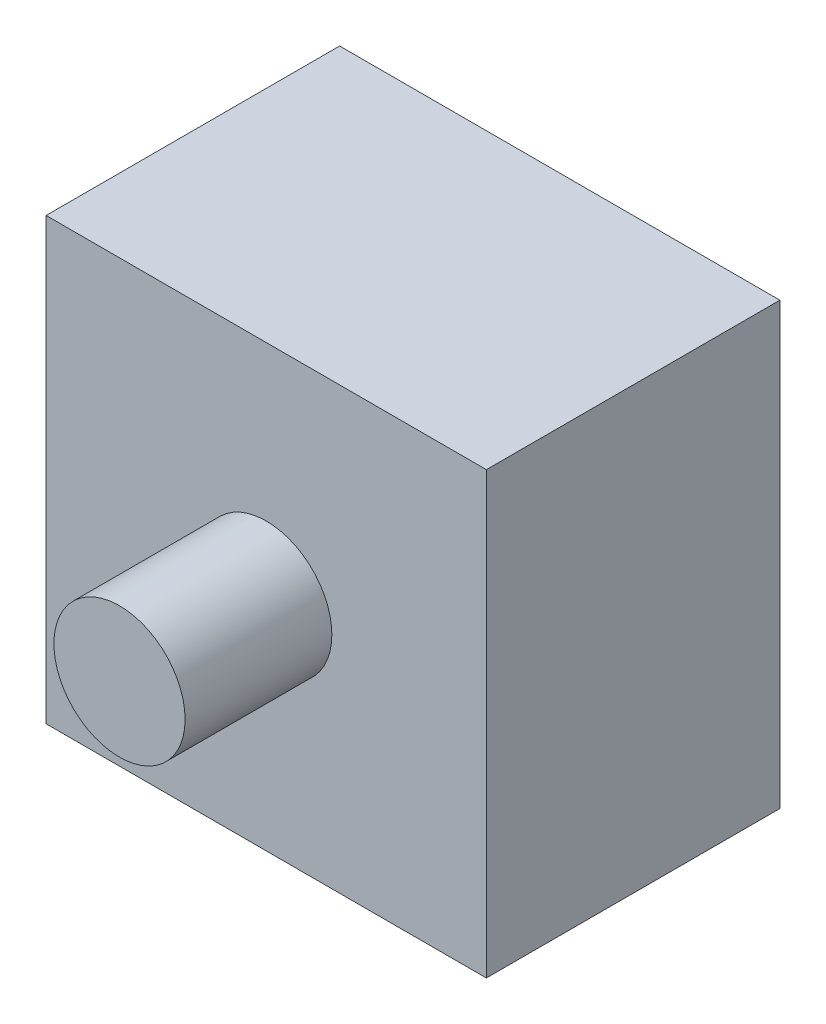
ISO-10303-21;
HEADER;
FILE_DESCRIPTION(('STEP AP214'),'2;1');
FILE_NAME('part.step','',(''),(''),'','','');
FILE_SCHEMA(('AUTOMOTIVE_DESIGN { 1 0 10303 214 1 1 1 1 }'));
ENDSEC;
DATA;
#1=APPLICATION_CONTEXT('core data for automotive mechanical design processes');
#2=APPLICATION_PROTOCOL_DEFINITION('international standard','automotive_design',2000,#1);
#3=PRODUCT_CONTEXT('',#1,'mechanical');
#4=PRODUCT('Part','Part','',(#3));
#5=PRODUCT_RELATED_PRODUCT_CATEGORY('part','',(#4));
#6=PRODUCT_DEFINITION_FORMATION('','',#4);
#7=PRODUCT_DEFINITION_CONTEXT('part definition',#1,'design');
#8=PRODUCT_DEFINITION('design','',#6,#7);
#9=PRODUCT_DEFINITION_SHAPE('','',#8);
#10=(LENGTH_UNIT() NAMED_UNIT(*) SI_UNIT(.MILLI.,.METRE.));
#11=(NAMED_UNIT(*) PLANE_ANGLE_UNIT() SI_UNIT($,.RADIAN.));
#12=(NAMED_UNIT(*) SI_UNIT($,.STERADIAN.) SOLID_ANGLE_UNIT());
#13=UNCERTAINTY_MEASURE_WITH_UNIT(LENGTH_MEASURE(1.E-05),#10,'distance_accuracy_value','');
#14=(GEOMETRIC_REPRESENTATION_CONTEXT(3) GLOBAL_UNCERTAINTY_ASSIGNED_CONTEXT((#13)) GLOBAL_UNIT_ASSIGNED_CONTEXT((#10,
#11,#12)) REPRESENTATION_CONTEXT('',''));
#15=CARTESIAN_POINT('',(0.,0.,0.));
#16=DIRECTION('',(0.,0.,1.));
#17=DIRECTION('',(1.,0.,0.));
#18=AXIS2_PLACEMENT_3D('',#15,#16,#17);
#19=CARTESIAN_POINT('',(1.5,-1.5,2.));
#20=DIRECTION('',(-1.,0.,0.));
#21=DIRECTION('',(0.,0.,1.));
#22=AXIS2_PLACEMENT_3D('',#19,#20,#21);
#23=PLANE('',#22);
#24=DIRECTION('',(0.,1.,0.));
#25=VECTOR('',#24,1.);
#26=CARTESIAN_POINT('',(1.5,-1.5,0.));
#27=LINE('',#26,#25);
#28=CARTESIAN_POINT('',(1.5,-1.5,0.));
#29=VERTEX_POINT('',#28);
#30=CARTESIAN_POINT('',(1.5,1.5,0.));
#31=VERTEX_POINT('',#30);
#32=EDGE_CURVE('E102',#29,#31,#27,.T.);
#33=ORIENTED_EDGE('',*,*,#32,.T.);
#34=DIRECTION('',(0.,0.,-1.));
#35=VECTOR('',#34,1.);
#36=CARTESIAN_POINT('',(1.5,1.5,2.));
#37=LINE('',#36,#35);
#38=CARTESIAN_POINT('',(1.5,1.5,2.));
#39=VERTEX_POINT('',#38);
#40=EDGE_CURVE('E39',#39,#31,#37,.T.);
#41=ORIENTED_EDGE('',*,*,#40,.F.);
#42=DIRECTION('',(0.,1.,0.));
#43=VECTOR('',#42,1.);
#44=CARTESIAN_POINT('',(1.5,-1.5,2.));
#45=LINE('',#44,#43);
#46=CARTESIAN_POINT('',(1.5,-1.5,2.));
#47=VERTEX_POINT('',#46);
#48=EDGE_CURVE('E89',#47,#39,#45,.T.);
#49=ORIENTED_EDGE('',*,*,#48,.F.);
#50=DIRECTION('',(0.,0.,-1.));
#51=VECTOR('',#50,1.);
#52=CARTESIAN_POINT('',(1.5,-1.5,2.));
#53=LINE('',#52,#51);
#54=EDGE_CURVE('E98',#47,#29,#53,.T.);
#55=ORIENTED_EDGE('',*,*,#54,.T.);
#56=EDGE_LOOP('',(#33,#41,#49,#55));
#57=FACE_BOUND('',#56,.T.);
#58=ADVANCED_FACE('F36',(#57),#23,.F.);
#59=CARTESIAN_POINT('',(-1.5,1.5,2.));
#60=DIRECTION('',(0.,-1.,0.));
#61=DIRECTION('',(0.,0.,-1.));
#62=AXIS2_PLACEMENT_3D('',#59,#60,#61);
#63=PLANE('',#62);
#64=DIRECTION('',(-1.,0.,0.));
#65=VECTOR('',#64,1.);
#66=CARTESIAN_POINT('',(-1.5,1.5,0.));
#67=LINE('',#66,#65);
#68=CARTESIAN_POINT('',(-1.5,1.5,0.));
#69=VERTEX_POINT('',#68);
#70=EDGE_CURVE('E94',#31,#69,#67,.T.);
#71=ORIENTED_EDGE('',*,*,#70,.T.);
#72=DIRECTION('',(0.,0.,-1.));
#73=VECTOR('',#72,1.);
#74=CARTESIAN_POINT('',(-1.5,1.5,2.));
#75=LINE('',#74,#73);
#76=CARTESIAN_POINT('',(-1.5,1.5,2.));
#77=VERTEX_POINT('',#76);
#78=EDGE_CURVE('E92',#77,#69,#75,.T.);
#79=ORIENTED_EDGE('',*,*,#78,.F.);
#80=DIRECTION('',(-1.,0.,0.));
#81=VECTOR('',#80,1.);
#82=CARTESIAN_POINT('',(-1.5,1.5,2.));
#83=LINE('',#82,#81);
#84=EDGE_CURVE('E84',#39,#77,#83,.T.);
#85=ORIENTED_EDGE('',*,*,#84,.F.);
#86=ORIENTED_EDGE('',*,*,#40,.T.);
#87=EDGE_LOOP('',(#71,#79,#85,#86));
#88=FACE_BOUND('',#87,.T.);
#89=ADVANCED_FACE('F93',(#88),#63,.F.);
#90=CARTESIAN_POINT('',(-1.5,-1.5,2.));
#91=DIRECTION('',(1.,0.,0.));
#92=DIRECTION('',(0.,0.,-1.));
#93=AXIS2_PLACEMENT_3D('',#90,#91,#92);
#94=PLANE('',#93);
#95=DIRECTION('',(0.,-1.,0.));
#96=VECTOR('',#95,1.);
#97=CARTESIAN_POINT('',(-1.5,-1.5,0.));
#98=LINE('',#97,#96);
#99=CARTESIAN_POINT('',(-1.5,-1.5,0.));
#100=VERTEX_POINT('',#99);
#101=EDGE_CURVE('E70',#69,#100,#98,.T.);
#102=ORIENTED_EDGE('',*,*,#101,.T.);
#103=DIRECTION('',(0.,0.,-1.));
#104=VECTOR('',#103,1.);
#105=CARTESIAN_POINT('',(-1.5,-1.5,2.));
#106=LINE('',#105,#104);
#107=CARTESIAN_POINT('',(-1.5,-1.5,2.));
#108=VERTEX_POINT('',#107);
#109=EDGE_CURVE('E95',#108,#100,#106,.T.);
#110=ORIENTED_EDGE('',*,*,#109,.F.);
#111=DIRECTION('',(0.,-1.,0.));
#112=VECTOR('',#111,1.);
#113=CARTESIAN_POINT('',(-1.5,-1.5,2.));
#114=LINE('',#113,#112);
#115=EDGE_CURVE('E87',#77,#108,#114,.T.);
#116=ORIENTED_EDGE('',*,*,#115,.F.);
#117=ORIENTED_EDGE('',*,*,#78,.T.);
#118=EDGE_LOOP('',(#102,#110,#116,#117));
#119=FACE_BOUND('',#118,.T.);
#120=ADVANCED_FACE('F96',(#119),#94,.F.);
#121=CARTESIAN_POINT('',(-1.5,-1.5,2.));
#122=DIRECTION('',(0.,1.,0.));
#123=DIRECTION('',(0.,0.,1.));
#124=AXIS2_PLACEMENT_3D('',#121,#122,#123);
#125=PLANE('',#124);
#126=DIRECTION('',(1.,0.,0.));
#127=VECTOR('',#126,1.);
#128=CARTESIAN_POINT('',(-1.5,-1.5,0.));
#129=LINE('',#128,#127);
#130=EDGE_CURVE('E76',#100,#29,#129,.T.);
#131=ORIENTED_EDGE('',*,*,#130,.T.);
#132=ORIENTED_EDGE('',*,*,#54,.F.);
#133=DIRECTION('',(1.,0.,0.));
#134=VECTOR('',#133,1.);
#135=CARTESIAN_POINT('',(-1.5,-1.5,2.));
#136=LINE('',#135,#134);
#137=EDGE_CURVE('E53',#108,#47,#136,.T.);
#138=ORIENTED_EDGE('',*,*,#137,.F.);
#139=ORIENTED_EDGE('',*,*,#109,.T.);
#140=EDGE_LOOP('',(#131,#132,#138,#139));
#141=FACE_BOUND('',#140,.T.);
#142=ADVANCED_FACE('F110',(#141),#125,.F.);
#143=CARTESIAN_POINT('',(0.,0.,2.));
#144=DIRECTION('',(0.,0.,-1.));
#145=DIRECTION('',(-1.,0.,0.));
#146=AXIS2_PLACEMENT_3D('',#143,#144,#145);
#147=PLANE('',#146);
#148=CARTESIAN_POINT('',(0.,0.,2.));
#149=DIRECTION('',(0.,0.,1.));
#150=DIRECTION('',(1.,0.,0.));
#151=AXIS2_PLACEMENT_3D('',#148,#149,#150);
#152=CIRCLE('',#151,0.447024559778655);
#153=CARTESIAN_POINT('',(0.447024559778655,0.,2.));
#154=VERTEX_POINT('',#153);
#155=EDGE_CURVE('E11',#154,#154,#152,.T.);
#156=ORIENTED_EDGE('',*,*,#155,.F.);
#157=EDGE_LOOP('',(#156));
#158=FACE_BOUND('',#157,.T.);
#159=ORIENTED_EDGE('',*,*,#48,.T.);
#160=ORIENTED_EDGE('',*,*,#84,.T.);
#161=ORIENTED_EDGE('',*,*,#115,.T.);
#162=ORIENTED_EDGE('',*,*,#137,.T.);
#163=EDGE_LOOP('',(#159,#160,#161,#162));
#164=FACE_BOUND('',#163,.T.);
#165=ADVANCED_FACE('F85',(#158,#164),#147,.F.);
#166=CARTESIAN_POINT('',(0.,0.,0.));
#167=DIRECTION('',(0.,0.,-1.));
#168=DIRECTION('',(-1.,0.,0.));
#169=AXIS2_PLACEMENT_3D('',#166,#167,#168);
#170=PLANE('',#169);
#171=ORIENTED_EDGE('',*,*,#32,.F.);
#172=ORIENTED_EDGE('',*,*,#130,.F.);
#173=ORIENTED_EDGE('',*,*,#101,.F.);
#174=ORIENTED_EDGE('',*,*,#70,.F.);
#175=EDGE_LOOP('',(#171,#172,#173,#174));
#176=FACE_BOUND('',#175,.T.);
#177=ADVANCED_FACE('F113',(#176),#170,.T.);
#178=CARTESIAN_POINT('',(0.,0.,3.));
#179=DIRECTION('',(0.,0.,-1.));
#180=DIRECTION('',(-1.,0.,0.));
#181=AXIS2_PLACEMENT_3D('',#178,#179,#180);
#182=CYLINDRICAL_SURFACE('',#181,0.447024559778655);
#183=CARTESIAN_POINT('',(0.,0.,3.));
#184=DIRECTION('',(0.,0.,1.));
#185=DIRECTION('',(1.,0.,0.));
#186=AXIS2_PLACEMENT_3D('',#183,#184,#185);
#187=CIRCLE('',#186,0.447024559778655);
#188=CARTESIAN_POINT('',(0.447024559778655,0.,3.));
#189=VERTEX_POINT('',#188);
#190=EDGE_CURVE('E105',#189,#189,#187,.T.);
#191=ORIENTED_EDGE('',*,*,#190,.F.);
#192=EDGE_LOOP('',(#191));
#193=FACE_BOUND('',#192,.T.);
#194=ORIENTED_EDGE('',*,*,#155,.T.);
#195=EDGE_LOOP('',(#194));
#196=FACE_BOUND('',#195,.T.);
#197=ADVANCED_FACE('F121',(#193,#196),#182,.T.);
#198=CARTESIAN_POINT('',(0.,0.,3.));
#199=DIRECTION('',(0.,0.,1.));
#200=DIRECTION('',(1.,0.,0.));
#201=AXIS2_PLACEMENT_3D('',#198,#199,#200);
#202=PLANE('',#201);
#203=ORIENTED_EDGE('',*,*,#190,.T.);
#204=EDGE_LOOP('',(#203));
#205=FACE_BOUND('',#204,.T.);
#206=ADVANCED_FACE('F119',(#205),#202,.T.);
#207=CLOSED_SHELL('',(#58,#89,#120,#142,#165,#177,#197,#206));
#208=MANIFOLD_SOLID_BREP('B2',#207);
#209=ADVANCED_BREP_SHAPE_REPRESENTATION('',(#18,#208),#14);
#210=SHAPE_DEFINITION_REPRESENTATION(#9,#209);
ENDSEC;
END-ISO-10303-21;
